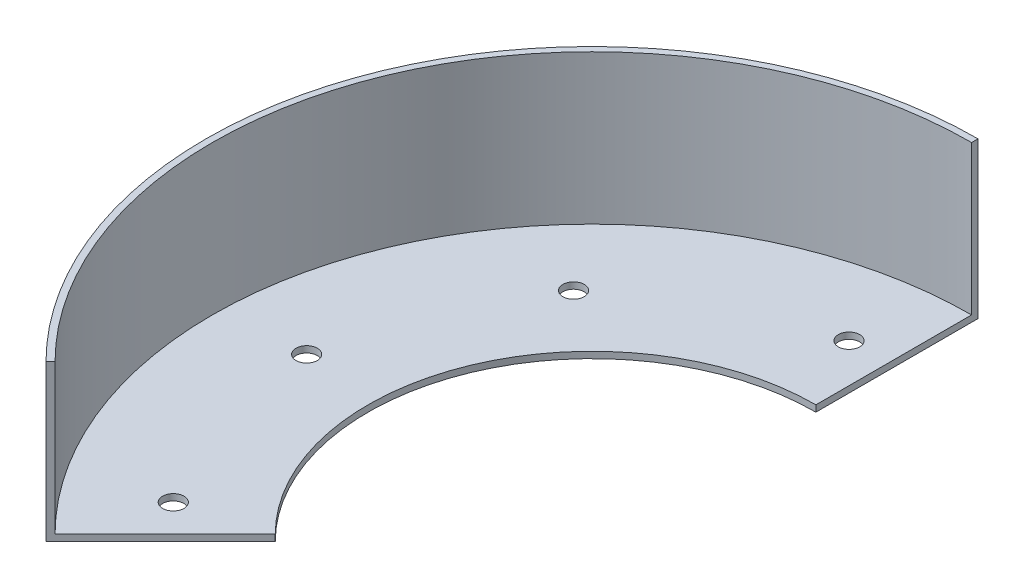
ISO-10303-21;
HEADER;
FILE_DESCRIPTION(('STEP AP214'),'2;1');
FILE_NAME('part.step','',(''),(''),'','','');
FILE_SCHEMA(('AUTOMOTIVE_DESIGN { 1 0 10303 214 1 1 1 1 }'));
ENDSEC;
DATA;
#1=APPLICATION_CONTEXT('core data for automotive mechanical design processes');
#2=APPLICATION_PROTOCOL_DEFINITION('international standard','automotive_design',2000,#1);
#3=PRODUCT_CONTEXT('',#1,'mechanical');
#4=PRODUCT('Part','Part','',(#3));
#5=PRODUCT_RELATED_PRODUCT_CATEGORY('part','',(#4));
#6=PRODUCT_DEFINITION_FORMATION('','',#4);
#7=PRODUCT_DEFINITION_CONTEXT('part definition',#1,'design');
#8=PRODUCT_DEFINITION('design','',#6,#7);
#9=PRODUCT_DEFINITION_SHAPE('','',#8);
#10=(LENGTH_UNIT() NAMED_UNIT(*) SI_UNIT(.MILLI.,.METRE.));
#11=(NAMED_UNIT(*) PLANE_ANGLE_UNIT() SI_UNIT($,.RADIAN.));
#12=(NAMED_UNIT(*) SI_UNIT($,.STERADIAN.) SOLID_ANGLE_UNIT());
#13=UNCERTAINTY_MEASURE_WITH_UNIT(LENGTH_MEASURE(1.E-05),#10,'distance_accuracy_value','');
#14=(GEOMETRIC_REPRESENTATION_CONTEXT(3) GLOBAL_UNCERTAINTY_ASSIGNED_CONTEXT((#13)) GLOBAL_UNIT_ASSIGNED_CONTEXT((#10,
#11,#12)) REPRESENTATION_CONTEXT('',''));
#15=CARTESIAN_POINT('',(0.,0.,0.));
#16=DIRECTION('',(0.,0.,1.));
#17=DIRECTION('',(1.,0.,0.));
#18=AXIS2_PLACEMENT_3D('',#15,#16,#17);
#19=CARTESIAN_POINT('',(0.,3.,0.));
#20=DIRECTION('',(0.,1.,0.));
#21=DIRECTION('',(0.,0.,1.));
#22=AXIS2_PLACEMENT_3D('',#19,#20,#21);
#23=PLANE('',#22);
#24=CARTESIAN_POINT('',(-139.864087078492,3.,-6.10659792088547));
#25=DIRECTION('',(0.,1.,0.));
#26=DIRECTION('',(0.,0.,1.));
#27=AXIS2_PLACEMENT_3D('',#24,#25,#26);
#28=CIRCLE('',#27,4.99999999999996);
#29=CARTESIAN_POINT('',(-139.864087078492,3.,-1.10659792088551));
#30=VERTEX_POINT('',#29);
#31=EDGE_CURVE('E134',#30,#30,#28,.T.);
#32=ORIENTED_EDGE('',*,*,#31,.F.);
#33=EDGE_LOOP('',(#32));
#34=FACE_BOUND('',#33,.T.);
#35=CARTESIAN_POINT('',(-103.216861217505,3.,-94.5808276178304));
#36=DIRECTION('',(0.,1.,0.));
#37=DIRECTION('',(0.,0.,1.));
#38=AXIS2_PLACEMENT_3D('',#35,#36,#37);
#39=CIRCLE('',#38,5.00000000000001);
#40=CARTESIAN_POINT('',(-103.216861217505,3.,-89.5808276178303));
#41=VERTEX_POINT('',#40);
#42=EDGE_CURVE('E195',#41,#41,#39,.T.);
#43=ORIENTED_EDGE('',*,*,#42,.F.);
#44=EDGE_LOOP('',(#43));
#45=FACE_BOUND('',#44,.T.);
#46=CARTESIAN_POINT('',(-18.2733188652124,3.,-138.79963692358));
#47=DIRECTION('',(0.,1.,0.));
#48=DIRECTION('',(0.,0.,1.));
#49=AXIS2_PLACEMENT_3D('',#46,#47,#48);
#50=CIRCLE('',#49,5.);
#51=CARTESIAN_POINT('',(-18.2733188652124,3.,-133.79963692358));
#52=VERTEX_POINT('',#51);
#53=EDGE_CURVE('E191',#52,#52,#50,.T.);
#54=ORIENTED_EDGE('',*,*,#53,.F.);
#55=EDGE_LOOP('',(#54));
#56=FACE_BOUND('',#55,.T.);
#57=CARTESIAN_POINT('',(-111.06735217927,3.,85.224976810518));
#58=DIRECTION('',(0.,1.,0.));
#59=DIRECTION('',(0.,0.,1.));
#60=AXIS2_PLACEMENT_3D('',#57,#58,#59);
#61=CIRCLE('',#60,5.00000000000001);
#62=CARTESIAN_POINT('',(-111.06735217927,3.,90.224976810518));
#63=VERTEX_POINT('',#62);
#64=EDGE_CURVE('E187',#63,#63,#61,.T.);
#65=ORIENTED_EDGE('',*,*,#64,.F.);
#66=EDGE_LOOP('',(#65));
#67=FACE_BOUND('',#66,.T.);
#68=CARTESIAN_POINT('',(0.,3.,0.));
#69=DIRECTION('',(0.,-1.,0.));
#70=DIRECTION('',(0.,0.,1.));
#71=AXIS2_PLACEMENT_3D('',#68,#69,#70);
#72=CIRCLE('',#71,178.);
#73=CARTESIAN_POINT('',(-125.865007051205,3.,125.865007051205));
#74=VERTEX_POINT('',#73);
#75=CARTESIAN_POINT('',(0.,3.,-178.));
#76=VERTEX_POINT('',#75);
#77=EDGE_CURVE('E57',#74,#76,#72,.T.);
#78=ORIENTED_EDGE('',*,*,#77,.F.);
#79=DIRECTION('',(0.707106781186548,0.,-0.707106781186548));
#80=VECTOR('',#79,1.);
#81=CARTESIAN_POINT('',(-127.986327394765,3.,127.986327394765));
#82=LINE('',#81,#80);
#83=CARTESIAN_POINT('',(-74.2462120245875,3.,74.2462120245875));
#84=VERTEX_POINT('',#83);
#85=EDGE_CURVE('E95',#74,#84,#82,.T.);
#86=ORIENTED_EDGE('',*,*,#85,.T.);
#87=CARTESIAN_POINT('',(0.,3.,0.));
#88=DIRECTION('',(0.,-1.,0.));
#89=DIRECTION('',(0.,0.,1.));
#90=AXIS2_PLACEMENT_3D('',#87,#88,#89);
#91=CIRCLE('',#90,105.);
#92=CARTESIAN_POINT('',(0.,3.,-105.));
#93=VERTEX_POINT('',#92);
#94=EDGE_CURVE('E63',#84,#93,#91,.T.);
#95=ORIENTED_EDGE('',*,*,#94,.T.);
#96=DIRECTION('',(0.,0.,-1.));
#97=VECTOR('',#96,1.);
#98=CARTESIAN_POINT('',(0.,3.,-105.));
#99=LINE('',#98,#97);
#100=EDGE_CURVE('E106',#93,#76,#99,.T.);
#101=ORIENTED_EDGE('',*,*,#100,.T.);
#102=EDGE_LOOP('',(#78,#86,#95,#101));
#103=FACE_BOUND('',#102,.T.);
#104=ADVANCED_FACE('F39',(#34,#45,#56,#67,#103),#23,.T.);
#105=CARTESIAN_POINT('',(0.,3.,0.));
#106=DIRECTION('',(0.,-1.,0.));
#107=DIRECTION('',(0.,0.,-1.));
#108=AXIS2_PLACEMENT_3D('',#105,#106,#107);
#109=CYLINDRICAL_SURFACE('',#108,181.);
#110=CARTESIAN_POINT('',(0.,0.,0.));
#111=DIRECTION('',(0.,1.,0.));
#112=DIRECTION('',(0.,0.,1.));
#113=AXIS2_PLACEMENT_3D('',#110,#111,#112);
#114=CIRCLE('',#113,181.);
#115=CARTESIAN_POINT('',(0.,0.,-181.));
#116=VERTEX_POINT('',#115);
#117=CARTESIAN_POINT('',(-127.986327394765,0.,127.986327394765));
#118=VERTEX_POINT('',#117);
#119=EDGE_CURVE('E102',#116,#118,#114,.T.);
#120=ORIENTED_EDGE('',*,*,#119,.T.);
#121=DIRECTION('',(0.,-1.,0.));
#122=VECTOR('',#121,1.);
#123=CARTESIAN_POINT('',(-127.986327394765,3.,127.986327394765));
#124=LINE('',#123,#122);
#125=CARTESIAN_POINT('',(-127.986327394765,73.,127.986327394765));
#126=VERTEX_POINT('',#125);
#127=EDGE_CURVE('E11',#126,#118,#124,.T.);
#128=ORIENTED_EDGE('',*,*,#127,.F.);
#129=CARTESIAN_POINT('',(0.,73.,0.));
#130=DIRECTION('',(0.,1.,0.));
#131=DIRECTION('',(0.,0.,1.));
#132=AXIS2_PLACEMENT_3D('',#129,#130,#131);
#133=CIRCLE('',#132,181.);
#134=CARTESIAN_POINT('',(0.,73.,-181.));
#135=VERTEX_POINT('',#134);
#136=EDGE_CURVE('E104',#135,#126,#133,.T.);
#137=ORIENTED_EDGE('',*,*,#136,.F.);
#138=DIRECTION('',(0.,-1.,0.));
#139=VECTOR('',#138,1.);
#140=CARTESIAN_POINT('',(0.,3.,-181.));
#141=LINE('',#140,#139);
#142=EDGE_CURVE('E87',#135,#116,#141,.T.);
#143=ORIENTED_EDGE('',*,*,#142,.T.);
#144=EDGE_LOOP('',(#120,#128,#137,#143));
#145=FACE_BOUND('',#144,.T.);
#146=ADVANCED_FACE('F41',(#145),#109,.T.);
#147=CARTESIAN_POINT('',(-127.986327394765,3.,127.986327394765));
#148=DIRECTION('',(-0.707106781186547,0.,-0.707106781186547));
#149=DIRECTION('',(-0.707106781186548,0.,0.707106781186548));
#150=AXIS2_PLACEMENT_3D('',#147,#148,#149);
#151=PLANE('',#150);
#152=DIRECTION('',(0.707106781186548,0.,-0.707106781186548));
#153=VECTOR('',#152,1.);
#154=CARTESIAN_POINT('',(-127.986327394765,0.,127.986327394765));
#155=LINE('',#154,#153);
#156=CARTESIAN_POINT('',(-74.2462120245875,0.,74.2462120245875));
#157=VERTEX_POINT('',#156);
#158=EDGE_CURVE('E109',#118,#157,#155,.T.);
#159=ORIENTED_EDGE('',*,*,#158,.T.);
#160=DIRECTION('',(0.,-1.,0.));
#161=VECTOR('',#160,1.);
#162=CARTESIAN_POINT('',(-74.2462120245875,3.,74.2462120245875));
#163=LINE('',#162,#161);
#164=EDGE_CURVE('E49',#84,#157,#163,.T.);
#165=ORIENTED_EDGE('',*,*,#164,.F.);
#166=ORIENTED_EDGE('',*,*,#85,.F.);
#167=DIRECTION('',(0.,-1.,0.));
#168=VECTOR('',#167,1.);
#169=CARTESIAN_POINT('',(-125.865007051205,73.,125.865007051205));
#170=LINE('',#169,#168);
#171=CARTESIAN_POINT('',(-125.865007051205,73.,125.865007051205));
#172=VERTEX_POINT('',#171);
#173=EDGE_CURVE('E111',#172,#74,#170,.T.);
#174=ORIENTED_EDGE('',*,*,#173,.F.);
#175=DIRECTION('',(0.707106781186534,0.,-0.707106781186561));
#176=VECTOR('',#175,1.);
#177=CARTESIAN_POINT('',(-127.986327394765,73.,127.986327394765));
#178=LINE('',#177,#176);
#179=EDGE_CURVE('E153',#126,#172,#178,.T.);
#180=ORIENTED_EDGE('',*,*,#179,.F.);
#181=ORIENTED_EDGE('',*,*,#127,.T.);
#182=EDGE_LOOP('',(#159,#165,#166,#174,#180,#181));
#183=FACE_BOUND('',#182,.T.);
#184=ADVANCED_FACE('F180',(#183),#151,.F.);
#185=CARTESIAN_POINT('',(0.,3.,0.));
#186=DIRECTION('',(0.,-1.,0.));
#187=DIRECTION('',(0.,0.,-1.));
#188=AXIS2_PLACEMENT_3D('',#185,#186,#187);
#189=CYLINDRICAL_SURFACE('',#188,105.);
#190=CARTESIAN_POINT('',(0.,0.,0.));
#191=DIRECTION('',(0.,-1.,0.));
#192=DIRECTION('',(0.,0.,1.));
#193=AXIS2_PLACEMENT_3D('',#190,#191,#192);
#194=CIRCLE('',#193,105.);
#195=CARTESIAN_POINT('',(0.,0.,-105.));
#196=VERTEX_POINT('',#195);
#197=EDGE_CURVE('E96',#157,#196,#194,.T.);
#198=ORIENTED_EDGE('',*,*,#197,.T.);
#199=DIRECTION('',(0.,-1.,0.));
#200=VECTOR('',#199,1.);
#201=CARTESIAN_POINT('',(0.,3.,-105.));
#202=LINE('',#201,#200);
#203=EDGE_CURVE('E90',#93,#196,#202,.T.);
#204=ORIENTED_EDGE('',*,*,#203,.F.);
#205=ORIENTED_EDGE('',*,*,#94,.F.);
#206=ORIENTED_EDGE('',*,*,#164,.T.);
#207=EDGE_LOOP('',(#198,#204,#205,#206));
#208=FACE_BOUND('',#207,.T.);
#209=ADVANCED_FACE('F229',(#208),#189,.F.);
#210=CARTESIAN_POINT('',(0.,3.,-105.));
#211=DIRECTION('',(-1.,0.,0.));
#212=DIRECTION('',(0.,0.,1.));
#213=AXIS2_PLACEMENT_3D('',#210,#211,#212);
#214=PLANE('',#213);
#215=DIRECTION('',(0.,0.,-1.));
#216=VECTOR('',#215,1.);
#217=CARTESIAN_POINT('',(0.,0.,-105.));
#218=LINE('',#217,#216);
#219=EDGE_CURVE('E83',#196,#116,#218,.T.);
#220=ORIENTED_EDGE('',*,*,#219,.T.);
#221=ORIENTED_EDGE('',*,*,#142,.F.);
#222=DIRECTION('',(0.,0.,-1.));
#223=VECTOR('',#222,1.);
#224=CARTESIAN_POINT('',(0.,73.,-181.));
#225=LINE('',#224,#223);
#226=CARTESIAN_POINT('',(0.,73.,-178.));
#227=VERTEX_POINT('',#226);
#228=EDGE_CURVE('E157',#227,#135,#225,.T.);
#229=ORIENTED_EDGE('',*,*,#228,.F.);
#230=DIRECTION('',(0.,-1.,0.));
#231=VECTOR('',#230,1.);
#232=CARTESIAN_POINT('',(0.,73.,-178.));
#233=LINE('',#232,#231);
#234=EDGE_CURVE('E117',#227,#76,#233,.T.);
#235=ORIENTED_EDGE('',*,*,#234,.T.);
#236=ORIENTED_EDGE('',*,*,#100,.F.);
#237=ORIENTED_EDGE('',*,*,#203,.T.);
#238=EDGE_LOOP('',(#220,#221,#229,#235,#236,#237));
#239=FACE_BOUND('',#238,.T.);
#240=ADVANCED_FACE('F85',(#239),#214,.F.);
#241=CARTESIAN_POINT('',(0.,0.,0.));
#242=DIRECTION('',(0.,1.,0.));
#243=DIRECTION('',(0.,0.,1.));
#244=AXIS2_PLACEMENT_3D('',#241,#242,#243);
#245=PLANE('',#244);
#246=CARTESIAN_POINT('',(-139.864087078492,0.,-6.10659792088547));
#247=DIRECTION('',(0.,1.,0.));
#248=DIRECTION('',(0.,0.,1.));
#249=AXIS2_PLACEMENT_3D('',#246,#247,#248);
#250=CIRCLE('',#249,4.99999999999996);
#251=CARTESIAN_POINT('',(-139.864087078492,0.,-1.10659792088551));
#252=VERTEX_POINT('',#251);
#253=EDGE_CURVE('E43',#252,#252,#250,.T.);
#254=ORIENTED_EDGE('',*,*,#253,.T.);
#255=EDGE_LOOP('',(#254));
#256=FACE_BOUND('',#255,.T.);
#257=CARTESIAN_POINT('',(-103.216861217505,0.,-94.5808276178304));
#258=DIRECTION('',(0.,1.,0.));
#259=DIRECTION('',(0.,0.,1.));
#260=AXIS2_PLACEMENT_3D('',#257,#258,#259);
#261=CIRCLE('',#260,5.00000000000001);
#262=CARTESIAN_POINT('',(-103.216861217505,0.,-89.5808276178303));
#263=VERTEX_POINT('',#262);
#264=EDGE_CURVE('E137',#263,#263,#261,.T.);
#265=ORIENTED_EDGE('',*,*,#264,.T.);
#266=EDGE_LOOP('',(#265));
#267=FACE_BOUND('',#266,.T.);
#268=CARTESIAN_POINT('',(-18.2733188652124,0.,-138.79963692358));
#269=DIRECTION('',(0.,1.,0.));
#270=DIRECTION('',(0.,0.,1.));
#271=AXIS2_PLACEMENT_3D('',#268,#269,#270);
#272=CIRCLE('',#271,5.);
#273=CARTESIAN_POINT('',(-18.2733188652124,0.,-133.79963692358));
#274=VERTEX_POINT('',#273);
#275=EDGE_CURVE('E133',#274,#274,#272,.T.);
#276=ORIENTED_EDGE('',*,*,#275,.T.);
#277=EDGE_LOOP('',(#276));
#278=FACE_BOUND('',#277,.T.);
#279=CARTESIAN_POINT('',(-111.06735217927,0.,85.224976810518));
#280=DIRECTION('',(0.,1.,0.));
#281=DIRECTION('',(0.,0.,1.));
#282=AXIS2_PLACEMENT_3D('',#279,#280,#281);
#283=CIRCLE('',#282,5.00000000000001);
#284=CARTESIAN_POINT('',(-111.06735217927,0.,90.224976810518));
#285=VERTEX_POINT('',#284);
#286=EDGE_CURVE('E129',#285,#285,#283,.T.);
#287=ORIENTED_EDGE('',*,*,#286,.T.);
#288=EDGE_LOOP('',(#287));
#289=FACE_BOUND('',#288,.T.);
#290=ORIENTED_EDGE('',*,*,#119,.F.);
#291=ORIENTED_EDGE('',*,*,#219,.F.);
#292=ORIENTED_EDGE('',*,*,#197,.F.);
#293=ORIENTED_EDGE('',*,*,#158,.F.);
#294=EDGE_LOOP('',(#290,#291,#292,#293));
#295=FACE_BOUND('',#294,.T.);
#296=ADVANCED_FACE('F108',(#256,#267,#278,#289,#295),#245,.F.);
#297=CARTESIAN_POINT('',(0.,73.,0.));
#298=DIRECTION('',(0.,-1.,0.));
#299=DIRECTION('',(0.,0.,-1.));
#300=AXIS2_PLACEMENT_3D('',#297,#298,#299);
#301=CYLINDRICAL_SURFACE('',#300,178.);
#302=ORIENTED_EDGE('',*,*,#77,.T.);
#303=ORIENTED_EDGE('',*,*,#234,.F.);
#304=CARTESIAN_POINT('',(0.,73.,0.));
#305=DIRECTION('',(0.,-1.,0.));
#306=DIRECTION('',(0.,0.,1.));
#307=AXIS2_PLACEMENT_3D('',#304,#305,#306);
#308=CIRCLE('',#307,178.);
#309=EDGE_CURVE('E170',#172,#227,#308,.T.);
#310=ORIENTED_EDGE('',*,*,#309,.F.);
#311=ORIENTED_EDGE('',*,*,#173,.T.);
#312=EDGE_LOOP('',(#302,#303,#310,#311));
#313=FACE_BOUND('',#312,.T.);
#314=ADVANCED_FACE('F167',(#313),#301,.F.);
#315=CARTESIAN_POINT('',(0.,73.,0.));
#316=DIRECTION('',(0.,1.,0.));
#317=DIRECTION('',(0.,0.,1.));
#318=AXIS2_PLACEMENT_3D('',#315,#316,#317);
#319=PLANE('',#318);
#320=ORIENTED_EDGE('',*,*,#136,.T.);
#321=ORIENTED_EDGE('',*,*,#179,.T.);
#322=ORIENTED_EDGE('',*,*,#309,.T.);
#323=ORIENTED_EDGE('',*,*,#228,.T.);
#324=EDGE_LOOP('',(#320,#321,#322,#323));
#325=FACE_BOUND('',#324,.T.);
#326=ADVANCED_FACE('F183',(#325),#319,.T.);
#327=CARTESIAN_POINT('',(-111.06735217927,-7.,85.224976810518));
#328=DIRECTION('',(0.,1.,0.));
#329=DIRECTION('',(0.,0.,1.));
#330=AXIS2_PLACEMENT_3D('',#327,#328,#329);
#331=CYLINDRICAL_SURFACE('',#330,5.00000000000001);
#332=ORIENTED_EDGE('',*,*,#64,.T.);
#333=EDGE_LOOP('',(#332));
#334=FACE_BOUND('',#333,.T.);
#335=ORIENTED_EDGE('',*,*,#286,.F.);
#336=EDGE_LOOP('',(#335));
#337=FACE_BOUND('',#336,.T.);
#338=ADVANCED_FACE('F215',(#334,#337),#331,.F.);
#339=CARTESIAN_POINT('',(-18.2733188652124,-7.,-138.79963692358));
#340=DIRECTION('',(0.,1.,0.));
#341=DIRECTION('',(0.,0.,1.));
#342=AXIS2_PLACEMENT_3D('',#339,#340,#341);
#343=CYLINDRICAL_SURFACE('',#342,5.);
#344=ORIENTED_EDGE('',*,*,#53,.T.);
#345=EDGE_LOOP('',(#344));
#346=FACE_BOUND('',#345,.T.);
#347=ORIENTED_EDGE('',*,*,#275,.F.);
#348=EDGE_LOOP('',(#347));
#349=FACE_BOUND('',#348,.T.);
#350=ADVANCED_FACE('F218',(#346,#349),#343,.F.);
#351=CARTESIAN_POINT('',(-103.216861217505,-7.,-94.5808276178304));
#352=DIRECTION('',(0.,1.,0.));
#353=DIRECTION('',(0.,0.,1.));
#354=AXIS2_PLACEMENT_3D('',#351,#352,#353);
#355=CYLINDRICAL_SURFACE('',#354,5.00000000000001);
#356=ORIENTED_EDGE('',*,*,#42,.T.);
#357=EDGE_LOOP('',(#356));
#358=FACE_BOUND('',#357,.T.);
#359=ORIENTED_EDGE('',*,*,#264,.F.);
#360=EDGE_LOOP('',(#359));
#361=FACE_BOUND('',#360,.T.);
#362=ADVANCED_FACE('F270',(#358,#361),#355,.F.);
#363=CARTESIAN_POINT('',(-139.864087078492,-7.,-6.10659792088547));
#364=DIRECTION('',(0.,1.,0.));
#365=DIRECTION('',(0.,0.,1.));
#366=AXIS2_PLACEMENT_3D('',#363,#364,#365);
#367=CYLINDRICAL_SURFACE('',#366,4.99999999999996);
#368=ORIENTED_EDGE('',*,*,#31,.T.);
#369=EDGE_LOOP('',(#368));
#370=FACE_BOUND('',#369,.T.);
#371=ORIENTED_EDGE('',*,*,#253,.F.);
#372=EDGE_LOOP('',(#371));
#373=FACE_BOUND('',#372,.T.);
#374=ADVANCED_FACE('F203',(#370,#373),#367,.F.);
#375=CLOSED_SHELL('',(#104,#146,#184,#209,#240,#296,#314,#326,#338,#350,#362,#374));
#376=MANIFOLD_SOLID_BREP('B2',#375);
#377=ADVANCED_BREP_SHAPE_REPRESENTATION('',(#18,#376),#14);
#378=SHAPE_DEFINITION_REPRESENTATION(#9,#377);
ENDSEC;
END-ISO-10303-21;
